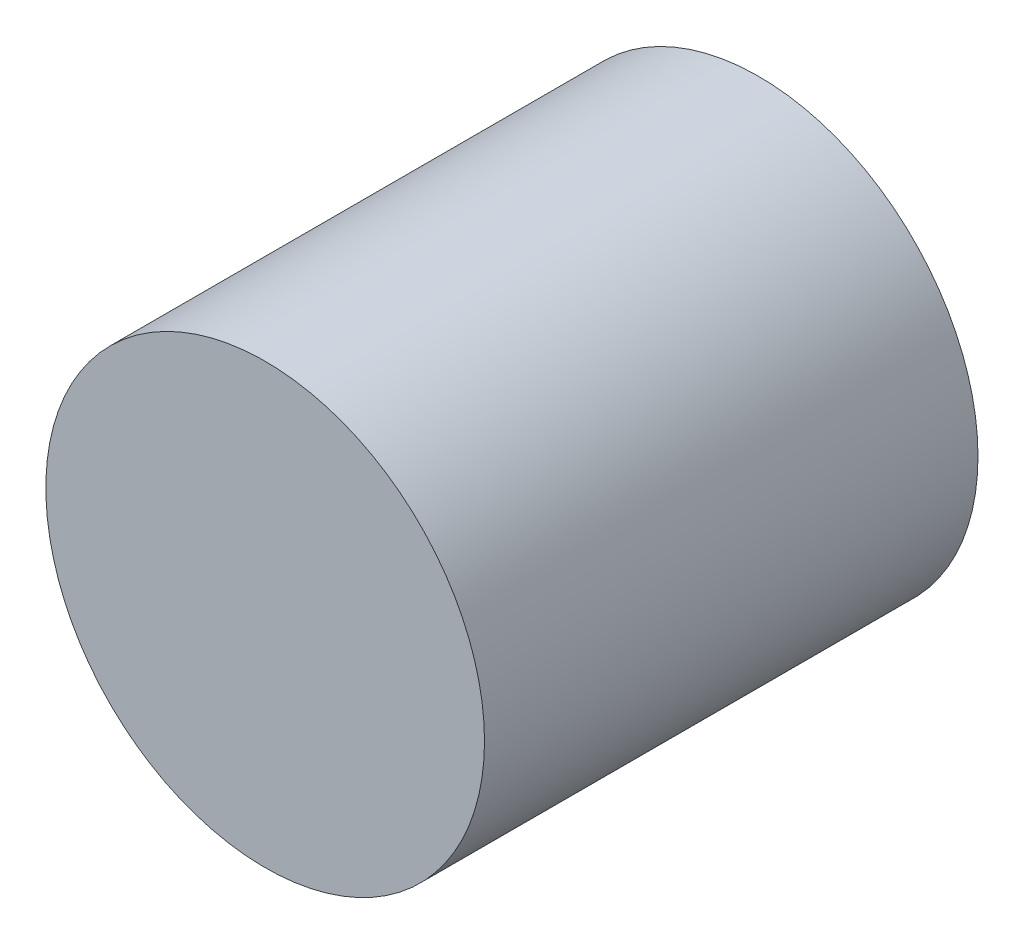
ISO-10303-21;
HEADER;
FILE_DESCRIPTION(('STEP AP214'),'2;1');
FILE_NAME('part.step','',(''),(''),'','','');
FILE_SCHEMA(('AUTOMOTIVE_DESIGN { 1 0 10303 214 1 1 1 1 }'));
ENDSEC;
DATA;
#1=APPLICATION_CONTEXT('core data for automotive mechanical design processes');
#2=APPLICATION_PROTOCOL_DEFINITION('international standard','automotive_design',2000,#1);
#3=PRODUCT_CONTEXT('',#1,'mechanical');
#4=PRODUCT('Part','Part','',(#3));
#5=PRODUCT_RELATED_PRODUCT_CATEGORY('part','',(#4));
#6=PRODUCT_DEFINITION_FORMATION('','',#4);
#7=PRODUCT_DEFINITION_CONTEXT('part definition',#1,'design');
#8=PRODUCT_DEFINITION('design','',#6,#7);
#9=PRODUCT_DEFINITION_SHAPE('','',#8);
#10=(LENGTH_UNIT() NAMED_UNIT(*) SI_UNIT(.MILLI.,.METRE.));
#11=(NAMED_UNIT(*) PLANE_ANGLE_UNIT() SI_UNIT($,.RADIAN.));
#12=(NAMED_UNIT(*) SI_UNIT($,.STERADIAN.) SOLID_ANGLE_UNIT());
#13=UNCERTAINTY_MEASURE_WITH_UNIT(LENGTH_MEASURE(1.E-05),#10,'distance_accuracy_value','');
#14=(GEOMETRIC_REPRESENTATION_CONTEXT(3) GLOBAL_UNCERTAINTY_ASSIGNED_CONTEXT((#13)) GLOBAL_UNIT_ASSIGNED_CONTEXT((#10,
#11,#12)) REPRESENTATION_CONTEXT('',''));
#15=CARTESIAN_POINT('',(0.,0.,0.));
#16=DIRECTION('',(0.,0.,1.));
#17=DIRECTION('',(1.,0.,0.));
#18=AXIS2_PLACEMENT_3D('',#15,#16,#17);
#19=CARTESIAN_POINT('',(8.89,0.,0.1));
#20=DIRECTION('',(0.,0.,1.));
#21=DIRECTION('',(1.,0.,0.));
#22=AXIS2_PLACEMENT_3D('',#19,#20,#21);
#23=PLANE('',#22);
#24=CARTESIAN_POINT('',(8.89,0.,0.1));
#25=DIRECTION('',(0.,0.,1.));
#26=DIRECTION('',(1.,0.,0.));
#27=AXIS2_PLACEMENT_3D('',#24,#25,#26);
#28=CIRCLE('',#27,0.8);
#29=CARTESIAN_POINT('',(9.69,0.,0.1));
#30=VERTEX_POINT('',#29);
#31=EDGE_CURVE('E17',#30,#30,#28,.F.);
#32=ORIENTED_EDGE('',*,*,#31,.F.);
#33=EDGE_LOOP('',(#32));
#34=FACE_BOUND('',#33,.T.);
#35=ADVANCED_FACE('F14',(#34),#23,.T.);
#36=CARTESIAN_POINT('',(8.89,0.,-1.7));
#37=DIRECTION('',(0.,0.,1.));
#38=DIRECTION('',(1.,0.,0.));
#39=AXIS2_PLACEMENT_3D('',#36,#37,#38);
#40=PLANE('',#39);
#41=CARTESIAN_POINT('',(8.89,0.,-1.7));
#42=DIRECTION('',(0.,0.,1.));
#43=DIRECTION('',(1.,0.,0.));
#44=AXIS2_PLACEMENT_3D('',#41,#42,#43);
#45=CIRCLE('',#44,0.8);
#46=CARTESIAN_POINT('',(9.69,0.,-1.7));
#47=VERTEX_POINT('',#46);
#48=EDGE_CURVE('E10',#47,#47,#45,.T.);
#49=ORIENTED_EDGE('',*,*,#48,.F.);
#50=EDGE_LOOP('',(#49));
#51=FACE_BOUND('',#50,.T.);
#52=ADVANCED_FACE('F29',(#51),#40,.F.);
#53=CARTESIAN_POINT('',(8.89,0.,-1.7));
#54=DIRECTION('',(0.,0.,1.));
#55=DIRECTION('',(1.,0.,0.));
#56=AXIS2_PLACEMENT_3D('',#53,#54,#55);
#57=CYLINDRICAL_SURFACE('',#56,0.8);
#58=ORIENTED_EDGE('',*,*,#48,.T.);
#59=EDGE_LOOP('',(#58));
#60=FACE_BOUND('',#59,.T.);
#61=ORIENTED_EDGE('',*,*,#31,.T.);
#62=EDGE_LOOP('',(#61));
#63=FACE_BOUND('',#62,.T.);
#64=ADVANCED_FACE('F26',(#60,#63),#57,.T.);
#65=CLOSED_SHELL('',(#35,#52,#64));
#66=MANIFOLD_SOLID_BREP('B1',#65);
#67=ADVANCED_BREP_SHAPE_REPRESENTATION('',(#18,#66),#14);
#68=SHAPE_DEFINITION_REPRESENTATION(#9,#67);
ENDSEC;
END-ISO-10303-21;
